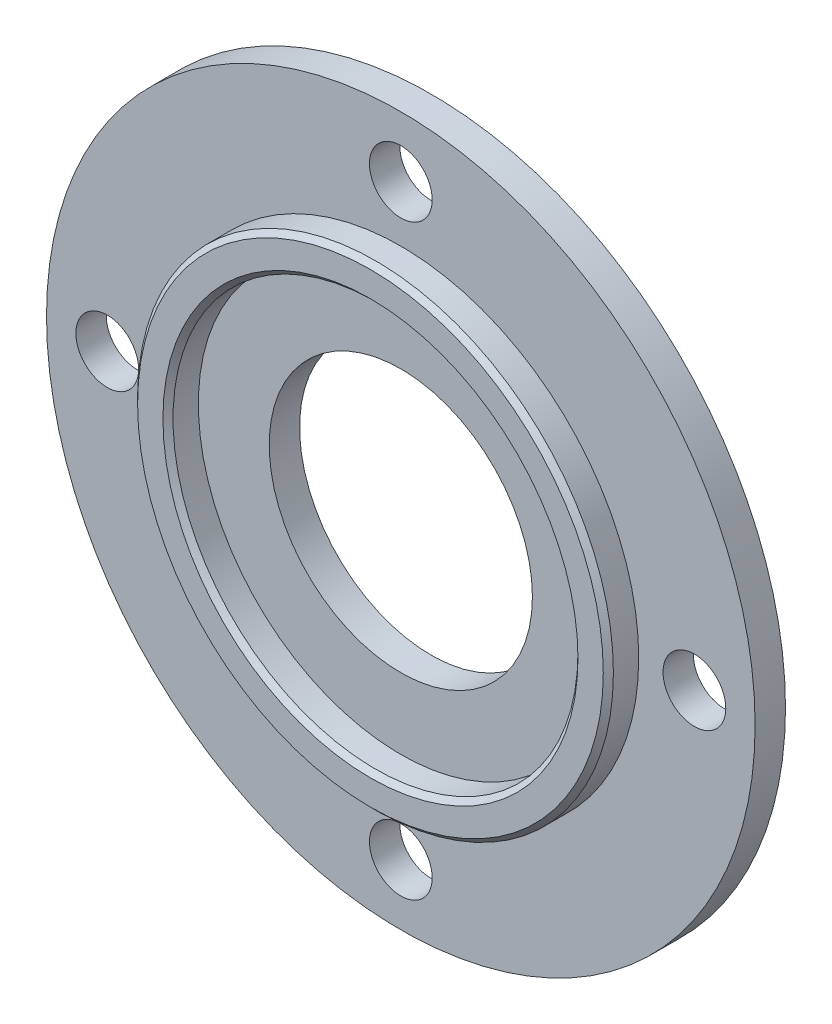
ISO-10303-21;
HEADER;
FILE_DESCRIPTION(('STEP AP214'),'2;1');
FILE_NAME('part.step','',(''),(''),'','','');
FILE_SCHEMA(('AUTOMOTIVE_DESIGN { 1 0 10303 214 1 1 1 1 }'));
ENDSEC;
DATA;
#1=APPLICATION_CONTEXT('core data for automotive mechanical design processes');
#2=APPLICATION_PROTOCOL_DEFINITION('international standard','automotive_design',2000,#1);
#3=PRODUCT_CONTEXT('',#1,'mechanical');
#4=PRODUCT('Part','Part','',(#3));
#5=PRODUCT_RELATED_PRODUCT_CATEGORY('part','',(#4));
#6=PRODUCT_DEFINITION_FORMATION('','',#4);
#7=PRODUCT_DEFINITION_CONTEXT('part definition',#1,'design');
#8=PRODUCT_DEFINITION('design','',#6,#7);
#9=PRODUCT_DEFINITION_SHAPE('','',#8);
#10=(LENGTH_UNIT() NAMED_UNIT(*) SI_UNIT(.MILLI.,.METRE.));
#11=(NAMED_UNIT(*) PLANE_ANGLE_UNIT() SI_UNIT($,.RADIAN.));
#12=(NAMED_UNIT(*) SI_UNIT($,.STERADIAN.) SOLID_ANGLE_UNIT());
#13=UNCERTAINTY_MEASURE_WITH_UNIT(LENGTH_MEASURE(1.E-05),#10,'distance_accuracy_value','');
#14=(GEOMETRIC_REPRESENTATION_CONTEXT(3) GLOBAL_UNCERTAINTY_ASSIGNED_CONTEXT((#13)) GLOBAL_UNIT_ASSIGNED_CONTEXT((#10,
#11,#12)) REPRESENTATION_CONTEXT('',''));
#15=CARTESIAN_POINT('',(0.,0.,0.));
#16=DIRECTION('',(0.,0.,1.));
#17=DIRECTION('',(1.,0.,0.));
#18=AXIS2_PLACEMENT_3D('',#15,#16,#17);
#19=CARTESIAN_POINT('',(0.,0.,3.));
#20=DIRECTION('',(0.,0.,1.));
#21=DIRECTION('',(1.,0.,0.));
#22=AXIS2_PLACEMENT_3D('',#19,#20,#21);
#23=PLANE('',#22);
#24=CARTESIAN_POINT('',(0.,0.,3.));
#25=DIRECTION('',(0.,0.,1.));
#26=DIRECTION('',(1.,0.,0.));
#27=AXIS2_PLACEMENT_3D('',#24,#25,#26);
#28=CIRCLE('',#27,13.);
#29=CARTESIAN_POINT('',(13.,0.,3.));
#30=VERTEX_POINT('',#29);
#31=EDGE_CURVE('E83',#30,#30,#28,.T.);
#32=ORIENTED_EDGE('',*,*,#31,.F.);
#33=EDGE_LOOP('',(#32));
#34=FACE_BOUND('',#33,.T.);
#35=CARTESIAN_POINT('',(0.,0.,3.));
#36=DIRECTION('',(0.,0.,1.));
#37=DIRECTION('',(1.,0.,0.));
#38=AXIS2_PLACEMENT_3D('',#35,#36,#37);
#39=CIRCLE('',#38,20.);
#40=CARTESIAN_POINT('',(20.,0.,3.));
#41=VERTEX_POINT('',#40);
#42=EDGE_CURVE('E70',#41,#41,#39,.F.);
#43=ORIENTED_EDGE('',*,*,#42,.F.);
#44=EDGE_LOOP('',(#43));
#45=FACE_BOUND('',#44,.T.);
#46=ADVANCED_FACE('F43',(#34,#45),#23,.T.);
#47=CARTESIAN_POINT('',(0.,0.,3.));
#48=DIRECTION('',(0.,0.,-1.));
#49=DIRECTION('',(-1.,0.,0.));
#50=AXIS2_PLACEMENT_3D('',#47,#48,#49);
#51=CYLINDRICAL_SURFACE('',#50,35.);
#52=CARTESIAN_POINT('',(0.,0.,3.));
#53=DIRECTION('',(0.,0.,1.));
#54=DIRECTION('',(1.,0.,0.));
#55=AXIS2_PLACEMENT_3D('',#52,#53,#54);
#56=CIRCLE('',#55,35.);
#57=CARTESIAN_POINT('',(35.,0.,3.));
#58=VERTEX_POINT('',#57);
#59=EDGE_CURVE('E74',#58,#58,#56,.T.);
#60=ORIENTED_EDGE('',*,*,#59,.F.);
#61=EDGE_LOOP('',(#60));
#62=FACE_BOUND('',#61,.T.);
#63=CARTESIAN_POINT('',(0.,0.,0.));
#64=DIRECTION('',(0.,0.,1.));
#65=DIRECTION('',(1.,0.,0.));
#66=AXIS2_PLACEMENT_3D('',#63,#64,#65);
#67=CIRCLE('',#66,35.);
#68=CARTESIAN_POINT('',(35.,0.,0.));
#69=VERTEX_POINT('',#68);
#70=EDGE_CURVE('E75',#69,#69,#67,.T.);
#71=ORIENTED_EDGE('',*,*,#70,.T.);
#72=EDGE_LOOP('',(#71));
#73=FACE_BOUND('',#72,.T.);
#74=ADVANCED_FACE('F134',(#62,#73),#51,.T.);
#75=CARTESIAN_POINT('',(0.,0.,3.));
#76=DIRECTION('',(0.,0.,1.));
#77=DIRECTION('',(1.,0.,0.));
#78=AXIS2_PLACEMENT_3D('',#75,#76,#77);
#79=CIRCLE('',#78,23.5);
#80=CARTESIAN_POINT('',(23.5,0.,3.));
#81=VERTEX_POINT('',#80);
#82=EDGE_CURVE('E112',#81,#81,#79,.T.);
#83=ORIENTED_EDGE('',*,*,#82,.F.);
#84=EDGE_LOOP('',(#83));
#85=FACE_BOUND('',#84,.T.);
#86=CARTESIAN_POINT('',(3.03758876479353E-13,29.,3.));
#87=DIRECTION('',(0.,0.,1.));
#88=DIRECTION('',(1.,0.,0.));
#89=AXIS2_PLACEMENT_3D('',#86,#87,#88);
#90=CIRCLE('',#89,3.1);
#91=CARTESIAN_POINT('',(3.1000000000003,29.,3.));
#92=VERTEX_POINT('',#91);
#93=EDGE_CURVE('E87',#92,#92,#90,.T.);
#94=ORIENTED_EDGE('',*,*,#93,.F.);
#95=EDGE_LOOP('',(#94));
#96=FACE_BOUND('',#95,.T.);
#97=CARTESIAN_POINT('',(29.,0.,3.));
#98=DIRECTION('',(0.,0.,1.));
#99=DIRECTION('',(1.,0.,0.));
#100=AXIS2_PLACEMENT_3D('',#97,#98,#99);
#101=CIRCLE('',#100,3.1);
#102=CARTESIAN_POINT('',(32.1,0.,3.));
#103=VERTEX_POINT('',#102);
#104=EDGE_CURVE('E95',#103,#103,#101,.T.);
#105=ORIENTED_EDGE('',*,*,#104,.F.);
#106=EDGE_LOOP('',(#105));
#107=FACE_BOUND('',#106,.T.);
#108=CARTESIAN_POINT('',(-1.01252958826451E-13,-29.,3.));
#109=DIRECTION('',(0.,0.,1.));
#110=DIRECTION('',(1.,0.,0.));
#111=AXIS2_PLACEMENT_3D('',#108,#109,#110);
#112=CIRCLE('',#111,3.1);
#113=CARTESIAN_POINT('',(3.09999999999989,-29.,3.));
#114=VERTEX_POINT('',#113);
#115=EDGE_CURVE('E96',#114,#114,#112,.T.);
#116=ORIENTED_EDGE('',*,*,#115,.F.);
#117=EDGE_LOOP('',(#116));
#118=FACE_BOUND('',#117,.T.);
#119=CARTESIAN_POINT('',(-29.,2.02505917652902E-13,3.));
#120=DIRECTION('',(0.,0.,1.));
#121=DIRECTION('',(1.,0.,0.));
#122=AXIS2_PLACEMENT_3D('',#119,#120,#121);
#123=CIRCLE('',#122,3.1);
#124=CARTESIAN_POINT('',(-25.9,2.02505917652902E-13,3.));
#125=VERTEX_POINT('',#124);
#126=EDGE_CURVE('E111',#125,#125,#123,.T.);
#127=ORIENTED_EDGE('',*,*,#126,.F.);
#128=EDGE_LOOP('',(#127));
#129=FACE_BOUND('',#128,.T.);
#130=ORIENTED_EDGE('',*,*,#59,.T.);
#131=EDGE_LOOP('',(#130));
#132=FACE_BOUND('',#131,.T.);
#133=ADVANCED_FACE('F130',(#85,#96,#107,#118,#129,#132),#23,.T.);
#134=CARTESIAN_POINT('',(0.,0.,0.));
#135=DIRECTION('',(0.,0.,1.));
#136=DIRECTION('',(1.,0.,0.));
#137=AXIS2_PLACEMENT_3D('',#134,#135,#136);
#138=PLANE('',#137);
#139=CARTESIAN_POINT('',(3.03758876479353E-13,29.,0.));
#140=DIRECTION('',(0.,0.,1.));
#141=DIRECTION('',(1.,0.,0.));
#142=AXIS2_PLACEMENT_3D('',#139,#140,#141);
#143=CIRCLE('',#142,3.1);
#144=CARTESIAN_POINT('',(3.1000000000003,29.,0.));
#145=VERTEX_POINT('',#144);
#146=EDGE_CURVE('E100',#145,#145,#143,.T.);
#147=ORIENTED_EDGE('',*,*,#146,.T.);
#148=EDGE_LOOP('',(#147));
#149=FACE_BOUND('',#148,.T.);
#150=CARTESIAN_POINT('',(29.,0.,0.));
#151=DIRECTION('',(0.,0.,1.));
#152=DIRECTION('',(1.,0.,0.));
#153=AXIS2_PLACEMENT_3D('',#150,#151,#152);
#154=CIRCLE('',#153,3.1);
#155=CARTESIAN_POINT('',(32.1,0.,0.));
#156=VERTEX_POINT('',#155);
#157=EDGE_CURVE('E91',#156,#156,#154,.T.);
#158=ORIENTED_EDGE('',*,*,#157,.T.);
#159=EDGE_LOOP('',(#158));
#160=FACE_BOUND('',#159,.T.);
#161=CARTESIAN_POINT('',(-1.01252958826451E-13,-29.,0.));
#162=DIRECTION('',(0.,0.,1.));
#163=DIRECTION('',(1.,0.,0.));
#164=AXIS2_PLACEMENT_3D('',#161,#162,#163);
#165=CIRCLE('',#164,3.1);
#166=CARTESIAN_POINT('',(3.09999999999989,-29.,0.));
#167=VERTEX_POINT('',#166);
#168=EDGE_CURVE('E116',#167,#167,#165,.T.);
#169=ORIENTED_EDGE('',*,*,#168,.T.);
#170=EDGE_LOOP('',(#169));
#171=FACE_BOUND('',#170,.T.);
#172=CARTESIAN_POINT('',(-29.,2.02505917652902E-13,0.));
#173=DIRECTION('',(0.,0.,1.));
#174=DIRECTION('',(1.,0.,0.));
#175=AXIS2_PLACEMENT_3D('',#172,#173,#174);
#176=CIRCLE('',#175,3.1);
#177=CARTESIAN_POINT('',(-25.9,2.02505917652902E-13,0.));
#178=VERTEX_POINT('',#177);
#179=EDGE_CURVE('E107',#178,#178,#176,.T.);
#180=ORIENTED_EDGE('',*,*,#179,.T.);
#181=EDGE_LOOP('',(#180));
#182=FACE_BOUND('',#181,.T.);
#183=CARTESIAN_POINT('',(0.,0.,0.));
#184=DIRECTION('',(0.,0.,1.));
#185=DIRECTION('',(1.,0.,0.));
#186=AXIS2_PLACEMENT_3D('',#183,#184,#185);
#187=CIRCLE('',#186,13.);
#188=CARTESIAN_POINT('',(13.,0.,0.));
#189=VERTEX_POINT('',#188);
#190=EDGE_CURVE('E79',#189,#189,#187,.T.);
#191=ORIENTED_EDGE('',*,*,#190,.T.);
#192=EDGE_LOOP('',(#191));
#193=FACE_BOUND('',#192,.T.);
#194=ORIENTED_EDGE('',*,*,#70,.F.);
#195=EDGE_LOOP('',(#194));
#196=FACE_BOUND('',#195,.T.);
#197=ADVANCED_FACE('F133',(#149,#160,#171,#182,#193,#196),#138,.F.);
#198=CARTESIAN_POINT('',(0.,0.,0.));
#199=DIRECTION('',(0.,0.,1.));
#200=DIRECTION('',(1.,0.,0.));
#201=AXIS2_PLACEMENT_3D('',#198,#199,#200);
#202=CYLINDRICAL_SURFACE('',#201,13.);
#203=ORIENTED_EDGE('',*,*,#190,.F.);
#204=EDGE_LOOP('',(#203));
#205=FACE_BOUND('',#204,.T.);
#206=ORIENTED_EDGE('',*,*,#31,.T.);
#207=EDGE_LOOP('',(#206));
#208=FACE_BOUND('',#207,.T.);
#209=ADVANCED_FACE('F152',(#205,#208),#202,.F.);
#210=CARTESIAN_POINT('',(-29.,2.02505917652902E-13,0.));
#211=DIRECTION('',(0.,0.,1.));
#212=DIRECTION('',(1.,0.,0.));
#213=AXIS2_PLACEMENT_3D('',#210,#211,#212);
#214=CYLINDRICAL_SURFACE('',#213,3.1);
#215=ORIENTED_EDGE('',*,*,#179,.F.);
#216=EDGE_LOOP('',(#215));
#217=FACE_BOUND('',#216,.T.);
#218=ORIENTED_EDGE('',*,*,#126,.T.);
#219=EDGE_LOOP('',(#218));
#220=FACE_BOUND('',#219,.T.);
#221=ADVANCED_FACE('F158',(#217,#220),#214,.F.);
#222=CARTESIAN_POINT('',(-1.01252958826451E-13,-29.,0.));
#223=DIRECTION('',(0.,0.,1.));
#224=DIRECTION('',(1.,0.,0.));
#225=AXIS2_PLACEMENT_3D('',#222,#223,#224);
#226=CYLINDRICAL_SURFACE('',#225,3.1);
#227=ORIENTED_EDGE('',*,*,#168,.F.);
#228=EDGE_LOOP('',(#227));
#229=FACE_BOUND('',#228,.T.);
#230=ORIENTED_EDGE('',*,*,#115,.T.);
#231=EDGE_LOOP('',(#230));
#232=FACE_BOUND('',#231,.T.);
#233=ADVANCED_FACE('F173',(#229,#232),#226,.F.);
#234=CARTESIAN_POINT('',(29.,0.,0.));
#235=DIRECTION('',(0.,0.,1.));
#236=DIRECTION('',(1.,0.,0.));
#237=AXIS2_PLACEMENT_3D('',#234,#235,#236);
#238=CYLINDRICAL_SURFACE('',#237,3.1);
#239=ORIENTED_EDGE('',*,*,#157,.F.);
#240=EDGE_LOOP('',(#239));
#241=FACE_BOUND('',#240,.T.);
#242=ORIENTED_EDGE('',*,*,#104,.T.);
#243=EDGE_LOOP('',(#242));
#244=FACE_BOUND('',#243,.T.);
#245=ADVANCED_FACE('F169',(#241,#244),#238,.F.);
#246=CARTESIAN_POINT('',(3.03758876479353E-13,29.,0.));
#247=DIRECTION('',(0.,0.,1.));
#248=DIRECTION('',(1.,0.,0.));
#249=AXIS2_PLACEMENT_3D('',#246,#247,#248);
#250=CYLINDRICAL_SURFACE('',#249,3.1);
#251=ORIENTED_EDGE('',*,*,#146,.F.);
#252=EDGE_LOOP('',(#251));
#253=FACE_BOUND('',#252,.T.);
#254=ORIENTED_EDGE('',*,*,#93,.T.);
#255=EDGE_LOOP('',(#254));
#256=FACE_BOUND('',#255,.T.);
#257=ADVANCED_FACE('F172',(#253,#256),#250,.F.);
#258=CARTESIAN_POINT('',(0.,0.,6.));
#259=DIRECTION('',(0.,0.,1.));
#260=DIRECTION('',(1.,0.,0.));
#261=AXIS2_PLACEMENT_3D('',#258,#259,#260);
#262=PLANE('',#261);
#263=CARTESIAN_POINT('',(0.,0.,6.));
#264=DIRECTION('',(0.,0.,1.));
#265=DIRECTION('',(1.,0.,0.));
#266=AXIS2_PLACEMENT_3D('',#263,#264,#265);
#267=CIRCLE('',#266,20.5);
#268=CARTESIAN_POINT('',(20.5,0.,6.));
#269=VERTEX_POINT('',#268);
#270=EDGE_CURVE('E10',#269,#269,#267,.F.);
#271=ORIENTED_EDGE('',*,*,#270,.T.);
#272=EDGE_LOOP('',(#271));
#273=FACE_BOUND('',#272,.T.);
#274=CARTESIAN_POINT('',(0.,0.,6.));
#275=DIRECTION('',(0.,0.,1.));
#276=DIRECTION('',(1.,0.,0.));
#277=AXIS2_PLACEMENT_3D('',#274,#275,#276);
#278=CIRCLE('',#277,23.);
#279=CARTESIAN_POINT('',(23.,0.,6.));
#280=VERTEX_POINT('',#279);
#281=EDGE_CURVE('E64',#280,#280,#278,.T.);
#282=ORIENTED_EDGE('',*,*,#281,.T.);
#283=EDGE_LOOP('',(#282));
#284=FACE_BOUND('',#283,.T.);
#285=ADVANCED_FACE('F177',(#273,#284),#262,.T.);
#286=CARTESIAN_POINT('',(0.,0.,6.));
#287=DIRECTION('',(0.,0.,-1.));
#288=DIRECTION('',(-1.,0.,0.));
#289=AXIS2_PLACEMENT_3D('',#286,#287,#288);
#290=CYLINDRICAL_SURFACE('',#289,23.5);
#291=CARTESIAN_POINT('',(0.,0.,5.50000000000002));
#292=DIRECTION('',(0.,0.,1.));
#293=DIRECTION('',(1.,0.,0.));
#294=AXIS2_PLACEMENT_3D('',#291,#292,#293);
#295=CIRCLE('',#294,23.5);
#296=CARTESIAN_POINT('',(23.5,0.,5.50000000000002));
#297=VERTEX_POINT('',#296);
#298=EDGE_CURVE('E58',#297,#297,#295,.F.);
#299=ORIENTED_EDGE('',*,*,#298,.T.);
#300=EDGE_LOOP('',(#299));
#301=FACE_BOUND('',#300,.T.);
#302=ORIENTED_EDGE('',*,*,#82,.T.);
#303=EDGE_LOOP('',(#302));
#304=FACE_BOUND('',#303,.T.);
#305=ADVANCED_FACE('F128',(#301,#304),#290,.T.);
#306=CARTESIAN_POINT('',(0.,0.,6.));
#307=DIRECTION('',(0.,0.,-1.));
#308=DIRECTION('',(-1.,0.,0.));
#309=AXIS2_PLACEMENT_3D('',#306,#307,#308);
#310=CYLINDRICAL_SURFACE('',#309,20.);
#311=CARTESIAN_POINT('',(0.,0.,5.49999999999998));
#312=DIRECTION('',(0.,0.,1.));
#313=DIRECTION('',(1.,0.,0.));
#314=AXIS2_PLACEMENT_3D('',#311,#312,#313);
#315=CIRCLE('',#314,20.);
#316=CARTESIAN_POINT('',(20.,0.,5.49999999999998));
#317=VERTEX_POINT('',#316);
#318=EDGE_CURVE('E52',#317,#317,#315,.T.);
#319=ORIENTED_EDGE('',*,*,#318,.T.);
#320=EDGE_LOOP('',(#319));
#321=FACE_BOUND('',#320,.T.);
#322=ORIENTED_EDGE('',*,*,#42,.T.);
#323=EDGE_LOOP('',(#322));
#324=FACE_BOUND('',#323,.T.);
#325=ADVANCED_FACE('F187',(#321,#324),#310,.F.);
#326=CARTESIAN_POINT('',(0.,0.,6.));
#327=DIRECTION('',(0.,0.,-1.));
#328=DIRECTION('',(-1.,0.,0.));
#329=AXIS2_PLACEMENT_3D('',#326,#327,#328);
#330=CONICAL_SURFACE('',#329,23.,0.785398163397455);
#331=ORIENTED_EDGE('',*,*,#298,.F.);
#332=EDGE_LOOP('',(#331));
#333=FACE_BOUND('',#332,.T.);
#334=ORIENTED_EDGE('',*,*,#281,.F.);
#335=EDGE_LOOP('',(#334));
#336=FACE_BOUND('',#335,.T.);
#337=ADVANCED_FACE('F192',(#333,#336),#330,.T.);
#338=CARTESIAN_POINT('',(0.,0.,5.49999999999998));
#339=DIRECTION('',(0.,0.,1.));
#340=DIRECTION('',(1.,0.,0.));
#341=AXIS2_PLACEMENT_3D('',#338,#339,#340);
#342=CONICAL_SURFACE('',#341,20.,0.785398163397448);
#343=ORIENTED_EDGE('',*,*,#270,.F.);
#344=EDGE_LOOP('',(#343));
#345=FACE_BOUND('',#344,.T.);
#346=ORIENTED_EDGE('',*,*,#318,.F.);
#347=EDGE_LOOP('',(#346));
#348=FACE_BOUND('',#347,.T.);
#349=ADVANCED_FACE('F46',(#345,#348),#342,.F.);
#350=CLOSED_SHELL('',(#46,#74,#133,#197,#209,#221,#233,#245,#257,#285,#305,#325,#337,#349));
#351=MANIFOLD_SOLID_BREP('B2',#350);
#352=ADVANCED_BREP_SHAPE_REPRESENTATION('',(#18,#351),#14);
#353=SHAPE_DEFINITION_REPRESENTATION(#9,#352);
ENDSEC;
END-ISO-10303-21;
